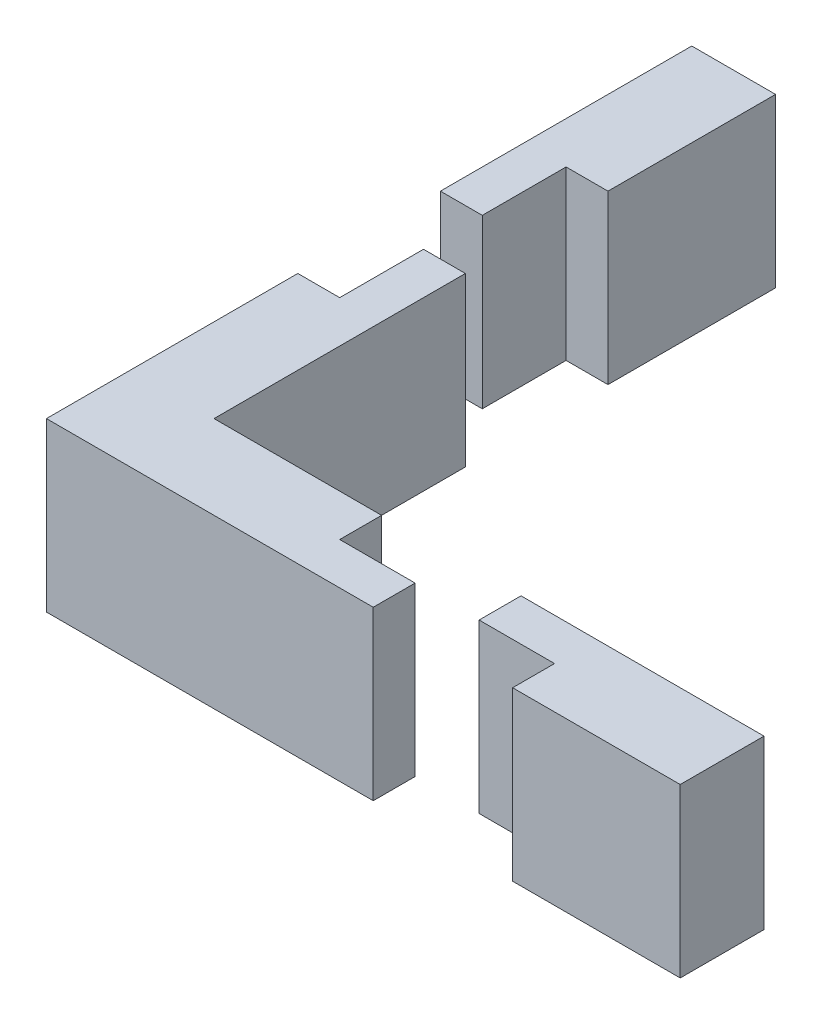
ISO-10303-21;
HEADER;
FILE_DESCRIPTION(('STEP AP214'),'2;1');
FILE_NAME('part.step','',(''),(''),'','','');
FILE_SCHEMA(('AUTOMOTIVE_DESIGN { 1 0 10303 214 1 1 1 1 }'));
ENDSEC;
DATA;
#1=APPLICATION_CONTEXT('core data for automotive mechanical design processes');
#2=APPLICATION_PROTOCOL_DEFINITION('international standard','automotive_design',2000,#1);
#3=PRODUCT_CONTEXT('',#1,'mechanical');
#4=PRODUCT('Part','Part','',(#3));
#5=PRODUCT_RELATED_PRODUCT_CATEGORY('part','',(#4));
#6=PRODUCT_DEFINITION_FORMATION('','',#4);
#7=PRODUCT_DEFINITION_CONTEXT('part definition',#1,'design');
#8=PRODUCT_DEFINITION('design','',#6,#7);
#9=PRODUCT_DEFINITION_SHAPE('','',#8);
#10=(LENGTH_UNIT() NAMED_UNIT(*) SI_UNIT(.MILLI.,.METRE.));
#11=(NAMED_UNIT(*) PLANE_ANGLE_UNIT() SI_UNIT($,.RADIAN.));
#12=(NAMED_UNIT(*) SI_UNIT($,.STERADIAN.) SOLID_ANGLE_UNIT());
#13=UNCERTAINTY_MEASURE_WITH_UNIT(LENGTH_MEASURE(1.E-05),#10,'distance_accuracy_value','');
#14=(GEOMETRIC_REPRESENTATION_CONTEXT(3) GLOBAL_UNCERTAINTY_ASSIGNED_CONTEXT((#13)) GLOBAL_UNIT_ASSIGNED_CONTEXT((#10,
#11,#12)) REPRESENTATION_CONTEXT('',''));
#15=CARTESIAN_POINT('',(0.,0.,0.));
#16=DIRECTION('',(0.,0.,1.));
#17=DIRECTION('',(1.,0.,0.));
#18=AXIS2_PLACEMENT_3D('',#15,#16,#17);
#19=CARTESIAN_POINT('',(0.,10.,5.));
#20=DIRECTION('',(0.,0.,-1.));
#21=DIRECTION('',(-1.,0.,0.));
#22=AXIS2_PLACEMENT_3D('',#19,#20,#21);
#23=PLANE('',#22);
#24=DIRECTION('',(1.,0.,0.));
#25=VECTOR('',#24,1.);
#26=CARTESIAN_POINT('',(0.,0.,5.));
#27=LINE('',#26,#25);
#28=CARTESIAN_POINT('',(20.8193978539841,0.,5.));
#29=VERTEX_POINT('',#28);
#30=CARTESIAN_POINT('',(25.3193978539841,0.,5.));
#31=VERTEX_POINT('',#30);
#32=EDGE_CURVE('E134',#29,#31,#27,.T.);
#33=ORIENTED_EDGE('',*,*,#32,.T.);
#34=DIRECTION('',(0.,-1.,0.));
#35=VECTOR('',#34,1.);
#36=CARTESIAN_POINT('',(25.3193978539841,10.,5.));
#37=LINE('',#36,#35);
#38=CARTESIAN_POINT('',(25.3193978539841,10.,5.));
#39=VERTEX_POINT('',#38);
#40=EDGE_CURVE('E12',#39,#31,#37,.T.);
#41=ORIENTED_EDGE('',*,*,#40,.F.);
#42=DIRECTION('',(1.,0.,0.));
#43=VECTOR('',#42,1.);
#44=CARTESIAN_POINT('',(0.,10.,5.));
#45=LINE('',#44,#43);
#46=CARTESIAN_POINT('',(20.8193978539841,10.,5.));
#47=VERTEX_POINT('',#46);
#48=EDGE_CURVE('E99',#47,#39,#45,.T.);
#49=ORIENTED_EDGE('',*,*,#48,.F.);
#50=DIRECTION('',(0.,-1.,0.));
#51=VECTOR('',#50,1.);
#52=CARTESIAN_POINT('',(20.8193978539841,10.,5.));
#53=LINE('',#52,#51);
#54=EDGE_CURVE('E68',#47,#29,#53,.T.);
#55=ORIENTED_EDGE('',*,*,#54,.T.);
#56=EDGE_LOOP('',(#33,#41,#49,#55));
#57=FACE_BOUND('',#56,.T.);
#58=ADVANCED_FACE('F52',(#57),#23,.F.);
#59=CARTESIAN_POINT('',(25.3193978539841,10.,0.));
#60=DIRECTION('',(-1.,0.,0.));
#61=DIRECTION('',(0.,0.,1.));
#62=AXIS2_PLACEMENT_3D('',#59,#60,#61);
#63=PLANE('',#62);
#64=DIRECTION('',(0.,0.,-1.));
#65=VECTOR('',#64,1.);
#66=CARTESIAN_POINT('',(25.3193978539841,0.,0.));
#67=LINE('',#66,#65);
#68=CARTESIAN_POINT('',(25.3193978539841,0.,7.5));
#69=VERTEX_POINT('',#68);
#70=EDGE_CURVE('E136',#69,#31,#67,.T.);
#71=ORIENTED_EDGE('',*,*,#70,.F.);
#72=DIRECTION('',(0.,-1.,0.));
#73=VECTOR('',#72,1.);
#74=CARTESIAN_POINT('',(25.3193978539841,10.,7.5));
#75=LINE('',#74,#73);
#76=CARTESIAN_POINT('',(25.3193978539841,10.,7.5));
#77=VERTEX_POINT('',#76);
#78=EDGE_CURVE('E60',#77,#69,#75,.T.);
#79=ORIENTED_EDGE('',*,*,#78,.F.);
#80=DIRECTION('',(0.,0.,-1.));
#81=VECTOR('',#80,1.);
#82=CARTESIAN_POINT('',(25.3193978539841,10.,0.));
#83=LINE('',#82,#81);
#84=EDGE_CURVE('E159',#77,#39,#83,.T.);
#85=ORIENTED_EDGE('',*,*,#84,.T.);
#86=ORIENTED_EDGE('',*,*,#40,.T.);
#87=EDGE_LOOP('',(#71,#79,#85,#86));
#88=FACE_BOUND('',#87,.T.);
#89=ADVANCED_FACE('F158',(#88),#63,.T.);
#90=CARTESIAN_POINT('',(0.,10.,7.5));
#91=DIRECTION('',(0.,0.,-1.));
#92=DIRECTION('',(-1.,0.,0.));
#93=AXIS2_PLACEMENT_3D('',#90,#91,#92);
#94=PLANE('',#93);
#95=DIRECTION('',(1.,0.,0.));
#96=VECTOR('',#95,1.);
#97=CARTESIAN_POINT('',(0.,0.,7.5));
#98=LINE('',#97,#96);
#99=CARTESIAN_POINT('',(35.3193978539841,0.,7.5));
#100=VERTEX_POINT('',#99);
#101=EDGE_CURVE('E139',#69,#100,#98,.T.);
#102=ORIENTED_EDGE('',*,*,#101,.T.);
#103=DIRECTION('',(0.,-1.,0.));
#104=VECTOR('',#103,1.);
#105=CARTESIAN_POINT('',(35.3193978539841,10.,7.5));
#106=LINE('',#105,#104);
#107=CARTESIAN_POINT('',(35.3193978539841,10.,7.5));
#108=VERTEX_POINT('',#107);
#109=EDGE_CURVE('E119',#108,#100,#106,.T.);
#110=ORIENTED_EDGE('',*,*,#109,.F.);
#111=DIRECTION('',(1.,0.,0.));
#112=VECTOR('',#111,1.);
#113=CARTESIAN_POINT('',(0.,10.,7.5));
#114=LINE('',#113,#112);
#115=EDGE_CURVE('E125',#77,#108,#114,.T.);
#116=ORIENTED_EDGE('',*,*,#115,.F.);
#117=ORIENTED_EDGE('',*,*,#78,.T.);
#118=EDGE_LOOP('',(#102,#110,#116,#117));
#119=FACE_BOUND('',#118,.T.);
#120=ADVANCED_FACE('F152',(#119),#94,.F.);
#121=CARTESIAN_POINT('',(35.3193978539841,10.,0.));
#122=DIRECTION('',(1.,0.,0.));
#123=DIRECTION('',(0.,0.,-1.));
#124=AXIS2_PLACEMENT_3D('',#121,#122,#123);
#125=PLANE('',#124);
#126=DIRECTION('',(0.,0.,1.));
#127=VECTOR('',#126,1.);
#128=CARTESIAN_POINT('',(35.3193978539841,0.,0.));
#129=LINE('',#128,#127);
#130=CARTESIAN_POINT('',(35.3193978539841,0.,2.5));
#131=VERTEX_POINT('',#130);
#132=EDGE_CURVE('E115',#131,#100,#129,.T.);
#133=ORIENTED_EDGE('',*,*,#132,.F.);
#134=DIRECTION('',(0.,-1.,0.));
#135=VECTOR('',#134,1.);
#136=CARTESIAN_POINT('',(35.3193978539841,10.,2.5));
#137=LINE('',#136,#135);
#138=CARTESIAN_POINT('',(35.3193978539841,10.,2.5));
#139=VERTEX_POINT('',#138);
#140=EDGE_CURVE('E110',#139,#131,#137,.T.);
#141=ORIENTED_EDGE('',*,*,#140,.F.);
#142=DIRECTION('',(0.,0.,1.));
#143=VECTOR('',#142,1.);
#144=CARTESIAN_POINT('',(35.3193978539841,10.,0.));
#145=LINE('',#144,#143);
#146=EDGE_CURVE('E113',#139,#108,#145,.T.);
#147=ORIENTED_EDGE('',*,*,#146,.T.);
#148=ORIENTED_EDGE('',*,*,#109,.T.);
#149=EDGE_LOOP('',(#133,#141,#147,#148));
#150=FACE_BOUND('',#149,.T.);
#151=ADVANCED_FACE('F112',(#150),#125,.T.);
#152=CARTESIAN_POINT('',(0.,10.,2.5));
#153=DIRECTION('',(0.,0.,-1.));
#154=DIRECTION('',(-1.,0.,0.));
#155=AXIS2_PLACEMENT_3D('',#152,#153,#154);
#156=PLANE('',#155);
#157=DIRECTION('',(1.,0.,0.));
#158=VECTOR('',#157,1.);
#159=CARTESIAN_POINT('',(0.,0.,2.5));
#160=LINE('',#159,#158);
#161=CARTESIAN_POINT('',(20.8193978539841,0.,2.5));
#162=VERTEX_POINT('',#161);
#163=EDGE_CURVE('E143',#162,#131,#160,.T.);
#164=ORIENTED_EDGE('',*,*,#163,.F.);
#165=DIRECTION('',(0.,-1.,0.));
#166=VECTOR('',#165,1.);
#167=CARTESIAN_POINT('',(20.8193978539841,10.,2.5));
#168=LINE('',#167,#166);
#169=CARTESIAN_POINT('',(20.8193978539841,10.,2.5));
#170=VERTEX_POINT('',#169);
#171=EDGE_CURVE('E87',#170,#162,#168,.T.);
#172=ORIENTED_EDGE('',*,*,#171,.F.);
#173=DIRECTION('',(1.,0.,0.));
#174=VECTOR('',#173,1.);
#175=CARTESIAN_POINT('',(0.,10.,2.5));
#176=LINE('',#175,#174);
#177=EDGE_CURVE('E123',#170,#139,#176,.T.);
#178=ORIENTED_EDGE('',*,*,#177,.T.);
#179=ORIENTED_EDGE('',*,*,#140,.T.);
#180=EDGE_LOOP('',(#164,#172,#178,#179));
#181=FACE_BOUND('',#180,.T.);
#182=ADVANCED_FACE('F128',(#181),#156,.T.);
#183=CARTESIAN_POINT('',(20.8193978539841,10.,0.));
#184=DIRECTION('',(-1.,0.,0.));
#185=DIRECTION('',(0.,0.,1.));
#186=AXIS2_PLACEMENT_3D('',#183,#184,#185);
#187=PLANE('',#186);
#188=DIRECTION('',(0.,0.,-1.));
#189=VECTOR('',#188,1.);
#190=CARTESIAN_POINT('',(20.8193978539841,0.,0.));
#191=LINE('',#190,#189);
#192=EDGE_CURVE('E145',#29,#162,#191,.T.);
#193=ORIENTED_EDGE('',*,*,#192,.F.);
#194=ORIENTED_EDGE('',*,*,#54,.F.);
#195=DIRECTION('',(0.,0.,-1.));
#196=VECTOR('',#195,1.);
#197=CARTESIAN_POINT('',(20.8193978539841,10.,0.));
#198=LINE('',#197,#196);
#199=EDGE_CURVE('E129',#47,#170,#198,.T.);
#200=ORIENTED_EDGE('',*,*,#199,.T.);
#201=ORIENTED_EDGE('',*,*,#171,.T.);
#202=EDGE_LOOP('',(#193,#194,#200,#201));
#203=FACE_BOUND('',#202,.T.);
#204=ADVANCED_FACE('F160',(#203),#187,.T.);
#205=CARTESIAN_POINT('',(0.,10.,0.));
#206=DIRECTION('',(0.,1.,0.));
#207=DIRECTION('',(0.,0.,1.));
#208=AXIS2_PLACEMENT_3D('',#205,#206,#207);
#209=PLANE('',#208);
#210=ORIENTED_EDGE('',*,*,#48,.T.);
#211=ORIENTED_EDGE('',*,*,#84,.F.);
#212=ORIENTED_EDGE('',*,*,#115,.T.);
#213=ORIENTED_EDGE('',*,*,#146,.F.);
#214=ORIENTED_EDGE('',*,*,#177,.F.);
#215=ORIENTED_EDGE('',*,*,#199,.F.);
#216=EDGE_LOOP('',(#210,#211,#212,#213,#214,#215));
#217=FACE_BOUND('',#216,.T.);
#218=ADVANCED_FACE('F122',(#217),#209,.T.);
#219=CARTESIAN_POINT('',(0.,0.,0.));
#220=DIRECTION('',(0.,1.,0.));
#221=DIRECTION('',(0.,0.,1.));
#222=AXIS2_PLACEMENT_3D('',#219,#220,#221);
#223=PLANE('',#222);
#224=ORIENTED_EDGE('',*,*,#32,.F.);
#225=ORIENTED_EDGE('',*,*,#192,.T.);
#226=ORIENTED_EDGE('',*,*,#163,.T.);
#227=ORIENTED_EDGE('',*,*,#132,.T.);
#228=ORIENTED_EDGE('',*,*,#101,.F.);
#229=ORIENTED_EDGE('',*,*,#70,.T.);
#230=EDGE_LOOP('',(#224,#225,#226,#227,#228,#229));
#231=FACE_BOUND('',#230,.T.);
#232=ADVANCED_FACE('F157',(#231),#223,.F.);
#233=CLOSED_SHELL('',(#58,#89,#120,#151,#182,#204,#218,#232));
#234=MANIFOLD_SOLID_BREP('B2',#233);
#235=CARTESIAN_POINT('',(0.,10.,0.));
#236=DIRECTION('',(-1.,0.,0.));
#237=DIRECTION('',(0.,0.,1.));
#238=AXIS2_PLACEMENT_3D('',#235,#236,#237);
#239=PLANE('',#238);
#240=DIRECTION('',(0.,0.,-1.));
#241=VECTOR('',#240,1.);
#242=CARTESIAN_POINT('',(0.,0.,0.));
#243=LINE('',#242,#241);
#244=CARTESIAN_POINT('',(0.,0.,-7.5));
#245=VERTEX_POINT('',#244);
#246=CARTESIAN_POINT('',(0.,0.,-12.5));
#247=VERTEX_POINT('',#246);
#248=EDGE_CURVE('E361',#245,#247,#243,.T.);
#249=ORIENTED_EDGE('',*,*,#248,.F.);
#250=DIRECTION('',(0.,-1.,0.));
#251=VECTOR('',#250,1.);
#252=CARTESIAN_POINT('',(0.,10.,-7.5));
#253=LINE('',#252,#251);
#254=CARTESIAN_POINT('',(0.,10.,-7.5));
#255=VERTEX_POINT('',#254);
#256=EDGE_CURVE('E50',#255,#245,#253,.T.);
#257=ORIENTED_EDGE('',*,*,#256,.F.);
#258=DIRECTION('',(0.,0.,-1.));
#259=VECTOR('',#258,1.);
#260=CARTESIAN_POINT('',(0.,10.,0.));
#261=LINE('',#260,#259);
#262=CARTESIAN_POINT('',(0.,10.,-12.5));
#263=VERTEX_POINT('',#262);
#264=EDGE_CURVE('E394',#255,#263,#261,.T.);
#265=ORIENTED_EDGE('',*,*,#264,.T.);
#266=DIRECTION('',(0.,-1.,0.));
#267=VECTOR('',#266,1.);
#268=CARTESIAN_POINT('',(0.,10.,-12.5));
#269=LINE('',#268,#267);
#270=EDGE_CURVE('E306',#263,#247,#269,.T.);
#271=ORIENTED_EDGE('',*,*,#270,.T.);
#272=EDGE_LOOP('',(#249,#257,#265,#271));
#273=FACE_BOUND('',#272,.T.);
#274=ADVANCED_FACE('F249',(#273),#239,.T.);
#275=CARTESIAN_POINT('',(0.,10.,-7.5));
#276=DIRECTION('',(0.,0.,-1.));
#277=DIRECTION('',(-1.,0.,0.));
#278=AXIS2_PLACEMENT_3D('',#275,#276,#277);
#279=PLANE('',#278);
#280=DIRECTION('',(1.,0.,0.));
#281=VECTOR('',#280,1.);
#282=CARTESIAN_POINT('',(0.,0.,-7.5));
#283=LINE('',#282,#281);
#284=CARTESIAN_POINT('',(-2.5,0.,-7.5));
#285=VERTEX_POINT('',#284);
#286=EDGE_CURVE('E365',#285,#245,#283,.T.);
#287=ORIENTED_EDGE('',*,*,#286,.F.);
#288=DIRECTION('',(0.,-1.,0.));
#289=VECTOR('',#288,1.);
#290=CARTESIAN_POINT('',(-2.5,10.,-7.5));
#291=LINE('',#290,#289);
#292=CARTESIAN_POINT('',(-2.5,10.,-7.5));
#293=VERTEX_POINT('',#292);
#294=EDGE_CURVE('E258',#293,#285,#291,.T.);
#295=ORIENTED_EDGE('',*,*,#294,.F.);
#296=DIRECTION('',(1.,0.,0.));
#297=VECTOR('',#296,1.);
#298=CARTESIAN_POINT('',(0.,10.,-7.5));
#299=LINE('',#298,#297);
#300=EDGE_CURVE('E430',#293,#255,#299,.T.);
#301=ORIENTED_EDGE('',*,*,#300,.T.);
#302=ORIENTED_EDGE('',*,*,#256,.T.);
#303=EDGE_LOOP('',(#287,#295,#301,#302));
#304=FACE_BOUND('',#303,.T.);
#305=ADVANCED_FACE('F429',(#304),#279,.T.);
#306=CARTESIAN_POINT('',(-2.5,10.,0.));
#307=DIRECTION('',(1.,0.,0.));
#308=DIRECTION('',(0.,0.,-1.));
#309=AXIS2_PLACEMENT_3D('',#306,#307,#308);
#310=PLANE('',#309);
#311=DIRECTION('',(0.,0.,1.));
#312=VECTOR('',#311,1.);
#313=CARTESIAN_POINT('',(-2.5,0.,0.));
#314=LINE('',#313,#312);
#315=CARTESIAN_POINT('',(-2.5,0.,7.5));
#316=VERTEX_POINT('',#315);
#317=EDGE_CURVE('E369',#285,#316,#314,.T.);
#318=ORIENTED_EDGE('',*,*,#317,.T.);
#319=DIRECTION('',(0.,-1.,0.));
#320=VECTOR('',#319,1.);
#321=CARTESIAN_POINT('',(-2.5,10.,7.5));
#322=LINE('',#321,#320);
#323=CARTESIAN_POINT('',(-2.5,10.,7.5));
#324=VERTEX_POINT('',#323);
#325=EDGE_CURVE('E411',#324,#316,#322,.T.);
#326=ORIENTED_EDGE('',*,*,#325,.F.);
#327=DIRECTION('',(0.,0.,1.));
#328=VECTOR('',#327,1.);
#329=CARTESIAN_POINT('',(-2.5,10.,0.));
#330=LINE('',#329,#328);
#331=EDGE_CURVE('E420',#293,#324,#330,.T.);
#332=ORIENTED_EDGE('',*,*,#331,.F.);
#333=ORIENTED_EDGE('',*,*,#294,.T.);
#334=EDGE_LOOP('',(#318,#326,#332,#333));
#335=FACE_BOUND('',#334,.T.);
#336=ADVANCED_FACE('F418',(#335),#310,.F.);
#337=CARTESIAN_POINT('',(0.,10.,7.5));
#338=DIRECTION('',(0.,0.,-1.));
#339=DIRECTION('',(-1.,0.,0.));
#340=AXIS2_PLACEMENT_3D('',#337,#338,#339);
#341=PLANE('',#340);
#342=DIRECTION('',(1.,0.,0.));
#343=VECTOR('',#342,1.);
#344=CARTESIAN_POINT('',(0.,0.,7.5));
#345=LINE('',#344,#343);
#346=CARTESIAN_POINT('',(17.,0.,7.5));
#347=VERTEX_POINT('',#346);
#348=EDGE_CURVE('E372',#316,#347,#345,.T.);
#349=ORIENTED_EDGE('',*,*,#348,.T.);
#350=DIRECTION('',(0.,-1.,0.));
#351=VECTOR('',#350,1.);
#352=CARTESIAN_POINT('',(17.,10.,7.5));
#353=LINE('',#352,#351);
#354=CARTESIAN_POINT('',(17.,10.,7.5));
#355=VERTEX_POINT('',#354);
#356=EDGE_CURVE('E407',#355,#347,#353,.T.);
#357=ORIENTED_EDGE('',*,*,#356,.F.);
#358=DIRECTION('',(1.,0.,0.));
#359=VECTOR('',#358,1.);
#360=CARTESIAN_POINT('',(0.,10.,7.5));
#361=LINE('',#360,#359);
#362=EDGE_CURVE('E441',#324,#355,#361,.T.);
#363=ORIENTED_EDGE('',*,*,#362,.F.);
#364=ORIENTED_EDGE('',*,*,#325,.T.);
#365=EDGE_LOOP('',(#349,#357,#363,#364));
#366=FACE_BOUND('',#365,.T.);
#367=ADVANCED_FACE('F475',(#366),#341,.F.);
#368=CARTESIAN_POINT('',(17.,10.,0.));
#369=DIRECTION('',(-1.,0.,0.));
#370=DIRECTION('',(0.,0.,1.));
#371=AXIS2_PLACEMENT_3D('',#368,#369,#370);
#372=PLANE('',#371);
#373=DIRECTION('',(0.,0.,-1.));
#374=VECTOR('',#373,1.);
#375=CARTESIAN_POINT('',(17.,0.,0.));
#376=LINE('',#375,#374);
#377=CARTESIAN_POINT('',(17.,0.,5.));
#378=VERTEX_POINT('',#377);
#379=EDGE_CURVE('E375',#347,#378,#376,.T.);
#380=ORIENTED_EDGE('',*,*,#379,.T.);
#381=DIRECTION('',(0.,-1.,0.));
#382=VECTOR('',#381,1.);
#383=CARTESIAN_POINT('',(17.,10.,5.));
#384=LINE('',#383,#382);
#385=CARTESIAN_POINT('',(17.,10.,5.));
#386=VERTEX_POINT('',#385);
#387=EDGE_CURVE('E404',#386,#378,#384,.T.);
#388=ORIENTED_EDGE('',*,*,#387,.F.);
#389=DIRECTION('',(0.,0.,-1.));
#390=VECTOR('',#389,1.);
#391=CARTESIAN_POINT('',(17.,10.,0.));
#392=LINE('',#391,#390);
#393=EDGE_CURVE('E444',#355,#386,#392,.T.);
#394=ORIENTED_EDGE('',*,*,#393,.F.);
#395=ORIENTED_EDGE('',*,*,#356,.T.);
#396=EDGE_LOOP('',(#380,#388,#394,#395));
#397=FACE_BOUND('',#396,.T.);
#398=ADVANCED_FACE('F456',(#397),#372,.F.);
#399=CARTESIAN_POINT('',(0.,10.,5.));
#400=DIRECTION('',(0.,0.,-1.));
#401=DIRECTION('',(-1.,0.,0.));
#402=AXIS2_PLACEMENT_3D('',#399,#400,#401);
#403=PLANE('',#402);
#404=DIRECTION('',(1.,0.,0.));
#405=VECTOR('',#404,1.);
#406=CARTESIAN_POINT('',(0.,0.,5.));
#407=LINE('',#406,#405);
#408=CARTESIAN_POINT('',(12.5,0.,5.));
#409=VERTEX_POINT('',#408);
#410=EDGE_CURVE('E379',#409,#378,#407,.T.);
#411=ORIENTED_EDGE('',*,*,#410,.F.);
#412=DIRECTION('',(0.,-1.,0.));
#413=VECTOR('',#412,1.);
#414=CARTESIAN_POINT('',(12.5,10.,5.));
#415=LINE('',#414,#413);
#416=CARTESIAN_POINT('',(12.5,10.,5.));
#417=VERTEX_POINT('',#416);
#418=EDGE_CURVE('E401',#417,#409,#415,.T.);
#419=ORIENTED_EDGE('',*,*,#418,.F.);
#420=DIRECTION('',(1.,0.,0.));
#421=VECTOR('',#420,1.);
#422=CARTESIAN_POINT('',(0.,10.,5.));
#423=LINE('',#422,#421);
#424=EDGE_CURVE('E355',#417,#386,#423,.T.);
#425=ORIENTED_EDGE('',*,*,#424,.T.);
#426=ORIENTED_EDGE('',*,*,#387,.T.);
#427=EDGE_LOOP('',(#411,#419,#425,#426));
#428=FACE_BOUND('',#427,.T.);
#429=ADVANCED_FACE('F450',(#428),#403,.T.);
#430=CARTESIAN_POINT('',(12.5,10.,0.));
#431=DIRECTION('',(-1.,0.,0.));
#432=DIRECTION('',(0.,0.,1.));
#433=AXIS2_PLACEMENT_3D('',#430,#431,#432);
#434=PLANE('',#433);
#435=DIRECTION('',(0.,0.,-1.));
#436=VECTOR('',#435,1.);
#437=CARTESIAN_POINT('',(12.5,0.,0.));
#438=LINE('',#437,#436);
#439=CARTESIAN_POINT('',(12.5,0.,2.5));
#440=VERTEX_POINT('',#439);
#441=EDGE_CURVE('E383',#409,#440,#438,.T.);
#442=ORIENTED_EDGE('',*,*,#441,.T.);
#443=DIRECTION('',(0.,-1.,0.));
#444=VECTOR('',#443,1.);
#445=CARTESIAN_POINT('',(12.5,10.,2.5));
#446=LINE('',#445,#444);
#447=CARTESIAN_POINT('',(12.5,10.,2.5));
#448=VERTEX_POINT('',#447);
#449=EDGE_CURVE('E340',#448,#440,#446,.T.);
#450=ORIENTED_EDGE('',*,*,#449,.F.);
#451=DIRECTION('',(0.,0.,-1.));
#452=VECTOR('',#451,1.);
#453=CARTESIAN_POINT('',(12.5,10.,0.));
#454=LINE('',#453,#452);
#455=EDGE_CURVE('E350',#417,#448,#454,.T.);
#456=ORIENTED_EDGE('',*,*,#455,.F.);
#457=ORIENTED_EDGE('',*,*,#418,.T.);
#458=EDGE_LOOP('',(#442,#450,#456,#457));
#459=FACE_BOUND('',#458,.T.);
#460=ADVANCED_FACE('F459',(#459),#434,.F.);
#461=CARTESIAN_POINT('',(0.,10.,2.5));
#462=DIRECTION('',(0.,0.,-1.));
#463=DIRECTION('',(-1.,0.,0.));
#464=AXIS2_PLACEMENT_3D('',#461,#462,#463);
#465=PLANE('',#464);
#466=DIRECTION('',(1.,0.,0.));
#467=VECTOR('',#466,1.);
#468=CARTESIAN_POINT('',(0.,0.,2.5));
#469=LINE('',#468,#467);
#470=CARTESIAN_POINT('',(2.5,0.,2.5));
#471=VERTEX_POINT('',#470);
#472=EDGE_CURVE('E338',#471,#440,#469,.T.);
#473=ORIENTED_EDGE('',*,*,#472,.F.);
#474=DIRECTION('',(0.,-1.,0.));
#475=VECTOR('',#474,1.);
#476=CARTESIAN_POINT('',(2.5,10.,2.5));
#477=LINE('',#476,#475);
#478=CARTESIAN_POINT('',(2.5,10.,2.5));
#479=VERTEX_POINT('',#478);
#480=EDGE_CURVE('E332',#479,#471,#477,.T.);
#481=ORIENTED_EDGE('',*,*,#480,.F.);
#482=DIRECTION('',(1.,0.,0.));
#483=VECTOR('',#482,1.);
#484=CARTESIAN_POINT('',(0.,10.,2.5));
#485=LINE('',#484,#483);
#486=EDGE_CURVE('E336',#479,#448,#485,.T.);
#487=ORIENTED_EDGE('',*,*,#486,.T.);
#488=ORIENTED_EDGE('',*,*,#449,.T.);
#489=EDGE_LOOP('',(#473,#481,#487,#488));
#490=FACE_BOUND('',#489,.T.);
#491=ADVANCED_FACE('F334',(#490),#465,.T.);
#492=CARTESIAN_POINT('',(2.5,10.,0.));
#493=DIRECTION('',(-1.,0.,0.));
#494=DIRECTION('',(0.,0.,1.));
#495=AXIS2_PLACEMENT_3D('',#492,#493,#494);
#496=PLANE('',#495);
#497=DIRECTION('',(0.,0.,-1.));
#498=VECTOR('',#497,1.);
#499=CARTESIAN_POINT('',(2.5,0.,0.));
#500=LINE('',#499,#498);
#501=CARTESIAN_POINT('',(2.5,0.,-12.5));
#502=VERTEX_POINT('',#501);
#503=EDGE_CURVE('E299',#471,#502,#500,.T.);
#504=ORIENTED_EDGE('',*,*,#503,.T.);
#505=DIRECTION('',(0.,-1.,0.));
#506=VECTOR('',#505,1.);
#507=CARTESIAN_POINT('',(2.5,10.,-12.5));
#508=LINE('',#507,#506);
#509=CARTESIAN_POINT('',(2.5,10.,-12.5));
#510=VERTEX_POINT('',#509);
#511=EDGE_CURVE('E341',#510,#502,#508,.T.);
#512=ORIENTED_EDGE('',*,*,#511,.F.);
#513=DIRECTION('',(0.,0.,-1.));
#514=VECTOR('',#513,1.);
#515=CARTESIAN_POINT('',(2.5,10.,0.));
#516=LINE('',#515,#514);
#517=EDGE_CURVE('E343',#479,#510,#516,.T.);
#518=ORIENTED_EDGE('',*,*,#517,.F.);
#519=ORIENTED_EDGE('',*,*,#480,.T.);
#520=EDGE_LOOP('',(#504,#512,#518,#519));
#521=FACE_BOUND('',#520,.T.);
#522=ADVANCED_FACE('F344',(#521),#496,.F.);
#523=CARTESIAN_POINT('',(0.,10.,-12.5));
#524=DIRECTION('',(0.,0.,1.));
#525=DIRECTION('',(1.,0.,0.));
#526=AXIS2_PLACEMENT_3D('',#523,#524,#525);
#527=PLANE('',#526);
#528=DIRECTION('',(-1.,0.,0.));
#529=VECTOR('',#528,1.);
#530=CARTESIAN_POINT('',(0.,0.,-12.5));
#531=LINE('',#530,#529);
#532=EDGE_CURVE('E391',#502,#247,#531,.T.);
#533=ORIENTED_EDGE('',*,*,#532,.T.);
#534=ORIENTED_EDGE('',*,*,#270,.F.);
#535=DIRECTION('',(-1.,0.,0.));
#536=VECTOR('',#535,1.);
#537=CARTESIAN_POINT('',(0.,10.,-12.5));
#538=LINE('',#537,#536);
#539=EDGE_CURVE('E266',#510,#263,#538,.T.);
#540=ORIENTED_EDGE('',*,*,#539,.F.);
#541=ORIENTED_EDGE('',*,*,#511,.T.);
#542=EDGE_LOOP('',(#533,#534,#540,#541));
#543=FACE_BOUND('',#542,.T.);
#544=ADVANCED_FACE('F433',(#543),#527,.F.);
#545=CARTESIAN_POINT('',(0.,10.,0.));
#546=DIRECTION('',(0.,1.,0.));
#547=DIRECTION('',(0.,0.,1.));
#548=AXIS2_PLACEMENT_3D('',#545,#546,#547);
#549=PLANE('',#548);
#550=ORIENTED_EDGE('',*,*,#264,.F.);
#551=ORIENTED_EDGE('',*,*,#300,.F.);
#552=ORIENTED_EDGE('',*,*,#331,.T.);
#553=ORIENTED_EDGE('',*,*,#362,.T.);
#554=ORIENTED_EDGE('',*,*,#393,.T.);
#555=ORIENTED_EDGE('',*,*,#424,.F.);
#556=ORIENTED_EDGE('',*,*,#455,.T.);
#557=ORIENTED_EDGE('',*,*,#486,.F.);
#558=ORIENTED_EDGE('',*,*,#517,.T.);
#559=ORIENTED_EDGE('',*,*,#539,.T.);
#560=EDGE_LOOP('',(#550,#551,#552,#553,#554,#555,#556,#557,#558,#559));
#561=FACE_BOUND('',#560,.T.);
#562=ADVANCED_FACE('F347',(#561),#549,.T.);
#563=CARTESIAN_POINT('',(0.,0.,0.));
#564=DIRECTION('',(0.,1.,0.));
#565=DIRECTION('',(0.,0.,1.));
#566=AXIS2_PLACEMENT_3D('',#563,#564,#565);
#567=PLANE('',#566);
#568=ORIENTED_EDGE('',*,*,#248,.T.);
#569=ORIENTED_EDGE('',*,*,#532,.F.);
#570=ORIENTED_EDGE('',*,*,#503,.F.);
#571=ORIENTED_EDGE('',*,*,#472,.T.);
#572=ORIENTED_EDGE('',*,*,#441,.F.);
#573=ORIENTED_EDGE('',*,*,#410,.T.);
#574=ORIENTED_EDGE('',*,*,#379,.F.);
#575=ORIENTED_EDGE('',*,*,#348,.F.);
#576=ORIENTED_EDGE('',*,*,#317,.F.);
#577=ORIENTED_EDGE('',*,*,#286,.T.);
#578=EDGE_LOOP('',(#568,#569,#570,#571,#572,#573,#574,#575,#576,#577));
#579=FACE_BOUND('',#578,.T.);
#580=ADVANCED_FACE('F427',(#579),#567,.F.);
#581=CLOSED_SHELL('',(#274,#305,#336,#367,#398,#429,#460,#491,#522,#544,#562,#580));
#582=MANIFOLD_SOLID_BREP('B6',#581);
#583=CARTESIAN_POINT('',(0.,10.,-21.0084716137559));
#584=DIRECTION('',(0.,0.,-1.));
#585=DIRECTION('',(-1.,0.,0.));
#586=AXIS2_PLACEMENT_3D('',#583,#584,#585);
#587=PLANE('',#586);
#588=DIRECTION('',(1.,0.,0.));
#589=VECTOR('',#588,1.);
#590=CARTESIAN_POINT('',(0.,0.,-21.0084716137559));
#591=LINE('',#590,#589);
#592=CARTESIAN_POINT('',(0.,0.,-21.0084716137559));
#593=VERTEX_POINT('',#592);
#594=CARTESIAN_POINT('',(2.5,0.,-21.0084716137559));
#595=VERTEX_POINT('',#594);
#596=EDGE_CURVE('E677',#593,#595,#591,.T.);
#597=ORIENTED_EDGE('',*,*,#596,.T.);
#598=DIRECTION('',(0.,-1.,0.));
#599=VECTOR('',#598,1.);
#600=CARTESIAN_POINT('',(2.5,10.,-21.0084716137559));
#601=LINE('',#600,#599);
#602=CARTESIAN_POINT('',(2.5,10.,-21.0084716137559));
#603=VERTEX_POINT('',#602);
#604=EDGE_CURVE('E247',#603,#595,#601,.T.);
#605=ORIENTED_EDGE('',*,*,#604,.F.);
#606=DIRECTION('',(1.,0.,0.));
#607=VECTOR('',#606,1.);
#608=CARTESIAN_POINT('',(0.,10.,-21.0084716137559));
#609=LINE('',#608,#607);
#610=CARTESIAN_POINT('',(0.,10.,-21.0084716137559));
#611=VERTEX_POINT('',#610);
#612=EDGE_CURVE('E690',#611,#603,#609,.T.);
#613=ORIENTED_EDGE('',*,*,#612,.F.);
#614=DIRECTION('',(0.,-1.,0.));
#615=VECTOR('',#614,1.);
#616=CARTESIAN_POINT('',(0.,10.,-21.0084716137559));
#617=LINE('',#616,#615);
#618=EDGE_CURVE('E673',#611,#593,#617,.T.);
#619=ORIENTED_EDGE('',*,*,#618,.T.);
#620=EDGE_LOOP('',(#597,#605,#613,#619));
#621=FACE_BOUND('',#620,.T.);
#622=ADVANCED_FACE('F595',(#621),#587,.F.);
#623=CARTESIAN_POINT('',(2.5,10.,0.));
#624=DIRECTION('',(-1.,0.,0.));
#625=DIRECTION('',(0.,0.,1.));
#626=AXIS2_PLACEMENT_3D('',#623,#624,#625);
#627=PLANE('',#626);
#628=DIRECTION('',(0.,0.,-1.));
#629=VECTOR('',#628,1.);
#630=CARTESIAN_POINT('',(2.5,0.,0.));
#631=LINE('',#630,#629);
#632=CARTESIAN_POINT('',(2.5,0.,-31.0084716137559));
#633=VERTEX_POINT('',#632);
#634=EDGE_CURVE('E680',#595,#633,#631,.T.);
#635=ORIENTED_EDGE('',*,*,#634,.T.);
#636=DIRECTION('',(0.,-1.,0.));
#637=VECTOR('',#636,1.);
#638=CARTESIAN_POINT('',(2.5,10.,-31.0084716137559));
#639=LINE('',#638,#637);
#640=CARTESIAN_POINT('',(2.5,10.,-31.0084716137559));
#641=VERTEX_POINT('',#640);
#642=EDGE_CURVE('E603',#641,#633,#639,.T.);
#643=ORIENTED_EDGE('',*,*,#642,.F.);
#644=DIRECTION('',(0.,0.,-1.));
#645=VECTOR('',#644,1.);
#646=CARTESIAN_POINT('',(2.5,10.,0.));
#647=LINE('',#646,#645);
#648=EDGE_CURVE('E644',#603,#641,#647,.T.);
#649=ORIENTED_EDGE('',*,*,#648,.F.);
#650=ORIENTED_EDGE('',*,*,#604,.T.);
#651=EDGE_LOOP('',(#635,#643,#649,#650));
#652=FACE_BOUND('',#651,.T.);
#653=ADVANCED_FACE('F696',(#652),#627,.F.);
#654=CARTESIAN_POINT('',(0.,10.,-31.0084716137559));
#655=DIRECTION('',(0.,0.,-1.));
#656=DIRECTION('',(-1.,0.,0.));
#657=AXIS2_PLACEMENT_3D('',#654,#655,#656);
#658=PLANE('',#657);
#659=DIRECTION('',(1.,0.,0.));
#660=VECTOR('',#659,1.);
#661=CARTESIAN_POINT('',(0.,0.,-31.0084716137559));
#662=LINE('',#661,#660);
#663=CARTESIAN_POINT('',(-2.5,0.,-31.0084716137559));
#664=VERTEX_POINT('',#663);
#665=EDGE_CURVE('E683',#664,#633,#662,.T.);
#666=ORIENTED_EDGE('',*,*,#665,.F.);
#667=DIRECTION('',(0.,-1.,0.));
#668=VECTOR('',#667,1.);
#669=CARTESIAN_POINT('',(-2.5,10.,-31.0084716137559));
#670=LINE('',#669,#668);
#671=CARTESIAN_POINT('',(-2.5,10.,-31.0084716137559));
#672=VERTEX_POINT('',#671);
#673=EDGE_CURVE('E663',#672,#664,#670,.T.);
#674=ORIENTED_EDGE('',*,*,#673,.F.);
#675=DIRECTION('',(1.,0.,0.));
#676=VECTOR('',#675,1.);
#677=CARTESIAN_POINT('',(0.,10.,-31.0084716137559));
#678=LINE('',#677,#676);
#679=EDGE_CURVE('E669',#672,#641,#678,.T.);
#680=ORIENTED_EDGE('',*,*,#679,.T.);
#681=ORIENTED_EDGE('',*,*,#642,.T.);
#682=EDGE_LOOP('',(#666,#674,#680,#681));
#683=FACE_BOUND('',#682,.T.);
#684=ADVANCED_FACE('F695',(#683),#658,.T.);
#685=CARTESIAN_POINT('',(-2.5,10.,0.));
#686=DIRECTION('',(-1.,0.,0.));
#687=DIRECTION('',(0.,0.,1.));
#688=AXIS2_PLACEMENT_3D('',#685,#686,#687);
#689=PLANE('',#688);
#690=DIRECTION('',(0.,0.,-1.));
#691=VECTOR('',#690,1.);
#692=CARTESIAN_POINT('',(-2.5,0.,0.));
#693=LINE('',#692,#691);
#694=CARTESIAN_POINT('',(-2.5,0.,-16.0084716137559));
#695=VERTEX_POINT('',#694);
#696=EDGE_CURVE('E658',#695,#664,#693,.T.);
#697=ORIENTED_EDGE('',*,*,#696,.F.);
#698=DIRECTION('',(0.,-1.,0.));
#699=VECTOR('',#698,1.);
#700=CARTESIAN_POINT('',(-2.5,10.,-16.0084716137559));
#701=LINE('',#700,#699);
#702=CARTESIAN_POINT('',(-2.5,10.,-16.0084716137559));
#703=VERTEX_POINT('',#702);
#704=EDGE_CURVE('E653',#703,#695,#701,.T.);
#705=ORIENTED_EDGE('',*,*,#704,.F.);
#706=DIRECTION('',(0.,0.,-1.));
#707=VECTOR('',#706,1.);
#708=CARTESIAN_POINT('',(-2.5,10.,0.));
#709=LINE('',#708,#707);
#710=EDGE_CURVE('E656',#703,#672,#709,.T.);
#711=ORIENTED_EDGE('',*,*,#710,.T.);
#712=ORIENTED_EDGE('',*,*,#673,.T.);
#713=EDGE_LOOP('',(#697,#705,#711,#712));
#714=FACE_BOUND('',#713,.T.);
#715=ADVANCED_FACE('F655',(#714),#689,.T.);
#716=CARTESIAN_POINT('',(0.,10.,-16.0084716137559));
#717=DIRECTION('',(0.,0.,1.));
#718=DIRECTION('',(1.,0.,0.));
#719=AXIS2_PLACEMENT_3D('',#716,#717,#718);
#720=PLANE('',#719);
#721=DIRECTION('',(-1.,0.,0.));
#722=VECTOR('',#721,1.);
#723=CARTESIAN_POINT('',(0.,0.,-16.0084716137559));
#724=LINE('',#723,#722);
#725=CARTESIAN_POINT('',(0.,0.,-16.0084716137559));
#726=VERTEX_POINT('',#725);
#727=EDGE_CURVE('E687',#726,#695,#724,.T.);
#728=ORIENTED_EDGE('',*,*,#727,.F.);
#729=DIRECTION('',(0.,-1.,0.));
#730=VECTOR('',#729,1.);
#731=CARTESIAN_POINT('',(0.,10.,-16.0084716137559));
#732=LINE('',#731,#730);
#733=CARTESIAN_POINT('',(0.,10.,-16.0084716137559));
#734=VERTEX_POINT('',#733);
#735=EDGE_CURVE('E633',#734,#726,#732,.T.);
#736=ORIENTED_EDGE('',*,*,#735,.F.);
#737=DIRECTION('',(-1.,0.,0.));
#738=VECTOR('',#737,1.);
#739=CARTESIAN_POINT('',(0.,10.,-16.0084716137559));
#740=LINE('',#739,#738);
#741=EDGE_CURVE('E667',#734,#703,#740,.T.);
#742=ORIENTED_EDGE('',*,*,#741,.T.);
#743=ORIENTED_EDGE('',*,*,#704,.T.);
#744=EDGE_LOOP('',(#728,#736,#742,#743));
#745=FACE_BOUND('',#744,.T.);
#746=ADVANCED_FACE('F671',(#745),#720,.T.);
#747=CARTESIAN_POINT('',(0.,10.,0.));
#748=DIRECTION('',(-1.,0.,0.));
#749=DIRECTION('',(0.,0.,1.));
#750=AXIS2_PLACEMENT_3D('',#747,#748,#749);
#751=PLANE('',#750);
#752=DIRECTION('',(0.,0.,-1.));
#753=VECTOR('',#752,1.);
#754=CARTESIAN_POINT('',(0.,0.,0.));
#755=LINE('',#754,#753);
#756=EDGE_CURVE('E636',#726,#593,#755,.T.);
#757=ORIENTED_EDGE('',*,*,#756,.T.);
#758=ORIENTED_EDGE('',*,*,#618,.F.);
#759=DIRECTION('',(0.,0.,-1.));
#760=VECTOR('',#759,1.);
#761=CARTESIAN_POINT('',(0.,10.,0.));
#762=LINE('',#761,#760);
#763=EDGE_CURVE('E611',#734,#611,#762,.T.);
#764=ORIENTED_EDGE('',*,*,#763,.F.);
#765=ORIENTED_EDGE('',*,*,#735,.T.);
#766=EDGE_LOOP('',(#757,#758,#764,#765));
#767=FACE_BOUND('',#766,.T.);
#768=ADVANCED_FACE('F703',(#767),#751,.F.);
#769=CARTESIAN_POINT('',(0.,10.,0.));
#770=DIRECTION('',(0.,1.,0.));
#771=DIRECTION('',(0.,0.,1.));
#772=AXIS2_PLACEMENT_3D('',#769,#770,#771);
#773=PLANE('',#772);
#774=ORIENTED_EDGE('',*,*,#612,.T.);
#775=ORIENTED_EDGE('',*,*,#648,.T.);
#776=ORIENTED_EDGE('',*,*,#679,.F.);
#777=ORIENTED_EDGE('',*,*,#710,.F.);
#778=ORIENTED_EDGE('',*,*,#741,.F.);
#779=ORIENTED_EDGE('',*,*,#763,.T.);
#780=EDGE_LOOP('',(#774,#775,#776,#777,#778,#779));
#781=FACE_BOUND('',#780,.T.);
#782=ADVANCED_FACE('F666',(#781),#773,.T.);
#783=CARTESIAN_POINT('',(0.,0.,0.));
#784=DIRECTION('',(0.,1.,0.));
#785=DIRECTION('',(0.,0.,1.));
#786=AXIS2_PLACEMENT_3D('',#783,#784,#785);
#787=PLANE('',#786);
#788=ORIENTED_EDGE('',*,*,#596,.F.);
#789=ORIENTED_EDGE('',*,*,#756,.F.);
#790=ORIENTED_EDGE('',*,*,#727,.T.);
#791=ORIENTED_EDGE('',*,*,#696,.T.);
#792=ORIENTED_EDGE('',*,*,#665,.T.);
#793=ORIENTED_EDGE('',*,*,#634,.F.);
#794=EDGE_LOOP('',(#788,#789,#790,#791,#792,#793));
#795=FACE_BOUND('',#794,.T.);
#796=ADVANCED_FACE('F700',(#795),#787,.F.);
#797=CLOSED_SHELL('',(#622,#653,#684,#715,#746,#768,#782,#796));
#798=MANIFOLD_SOLID_BREP('B44',#797);
#799=ADVANCED_BREP_SHAPE_REPRESENTATION('',(#18,#234,#582,#798),#14);
#800=SHAPE_DEFINITION_REPRESENTATION(#9,#799);
ENDSEC;
END-ISO-10303-21;
